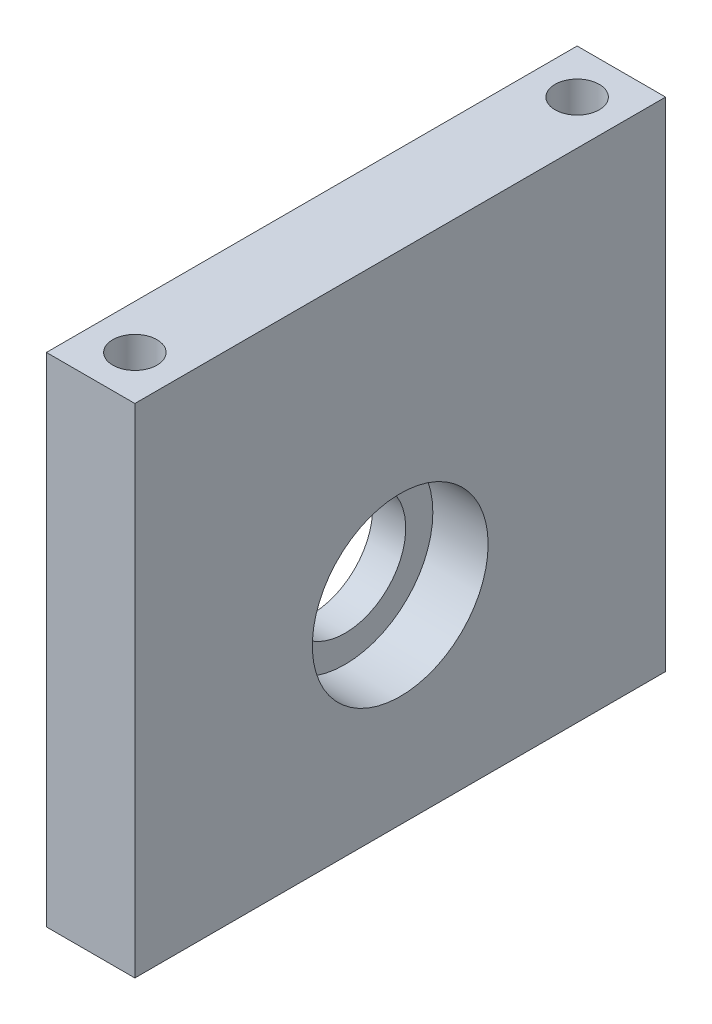
ISO-10303-21;
HEADER;
FILE_DESCRIPTION(('STEP AP214'),'2;1');
FILE_NAME('part.step','',(''),(''),'','','');
FILE_SCHEMA(('AUTOMOTIVE_DESIGN { 1 0 10303 214 1 1 1 1 }'));
ENDSEC;
DATA;
#1=APPLICATION_CONTEXT('core data for automotive mechanical design processes');
#2=APPLICATION_PROTOCOL_DEFINITION('international standard','automotive_design',2000,#1);
#3=PRODUCT_CONTEXT('',#1,'mechanical');
#4=PRODUCT('Part','Part','',(#3));
#5=PRODUCT_RELATED_PRODUCT_CATEGORY('part','',(#4));
#6=PRODUCT_DEFINITION_FORMATION('','',#4);
#7=PRODUCT_DEFINITION_CONTEXT('part definition',#1,'design');
#8=PRODUCT_DEFINITION('design','',#6,#7);
#9=PRODUCT_DEFINITION_SHAPE('','',#8);
#10=(LENGTH_UNIT() NAMED_UNIT(*) SI_UNIT(.MILLI.,.METRE.));
#11=(NAMED_UNIT(*) PLANE_ANGLE_UNIT() SI_UNIT($,.RADIAN.));
#12=(NAMED_UNIT(*) SI_UNIT($,.STERADIAN.) SOLID_ANGLE_UNIT());
#13=UNCERTAINTY_MEASURE_WITH_UNIT(LENGTH_MEASURE(1.E-05),#10,'distance_accuracy_value','');
#14=(GEOMETRIC_REPRESENTATION_CONTEXT(3) GLOBAL_UNCERTAINTY_ASSIGNED_CONTEXT((#13)) GLOBAL_UNIT_ASSIGNED_CONTEXT((#10,
#11,#12)) REPRESENTATION_CONTEXT('',''));
#15=CARTESIAN_POINT('',(0.,0.,0.));
#16=DIRECTION('',(0.,0.,1.));
#17=DIRECTION('',(1.,0.,0.));
#18=AXIS2_PLACEMENT_3D('',#15,#16,#17);
#19=CARTESIAN_POINT('',(-2.,18.,-24.));
#20=DIRECTION('',(1.,0.,0.));
#21=DIRECTION('',(0.,0.,-1.));
#22=AXIS2_PLACEMENT_3D('',#19,#20,#21);
#23=CYLINDRICAL_SURFACE('',#22,7.95);
#24=CARTESIAN_POINT('',(8.,18.,-24.));
#25=DIRECTION('',(1.,0.,0.));
#26=DIRECTION('',(0.,0.,-1.));
#27=AXIS2_PLACEMENT_3D('',#24,#25,#26);
#28=CIRCLE('',#27,7.95);
#29=CARTESIAN_POINT('',(8.,18.,-31.95));
#30=VERTEX_POINT('',#29);
#31=EDGE_CURVE('E111',#30,#30,#28,.T.);
#32=ORIENTED_EDGE('',*,*,#31,.T.);
#33=EDGE_LOOP('',(#32));
#34=FACE_BOUND('',#33,.T.);
#35=CARTESIAN_POINT('',(3.,18.,-24.));
#36=DIRECTION('',(-1.,0.,0.));
#37=DIRECTION('',(0.,0.,1.));
#38=AXIS2_PLACEMENT_3D('',#35,#36,#37);
#39=CIRCLE('',#38,7.95);
#40=CARTESIAN_POINT('',(3.,18.,-16.05));
#41=VERTEX_POINT('',#40);
#42=EDGE_CURVE('E11',#41,#41,#39,.F.);
#43=ORIENTED_EDGE('',*,*,#42,.F.);
#44=EDGE_LOOP('',(#43));
#45=FACE_BOUND('',#44,.T.);
#46=ADVANCED_FACE('F40',(#34,#45),#23,.F.);
#47=CARTESIAN_POINT('',(0.,45.,-48.));
#48=DIRECTION('',(0.,0.,1.));
#49=DIRECTION('',(1.,0.,0.));
#50=AXIS2_PLACEMENT_3D('',#47,#48,#49);
#51=PLANE('',#50);
#52=DIRECTION('',(-1.,0.,0.));
#53=VECTOR('',#52,1.);
#54=CARTESIAN_POINT('',(0.,0.,-48.));
#55=LINE('',#54,#53);
#56=CARTESIAN_POINT('',(8.,0.,-48.));
#57=VERTEX_POINT('',#56);
#58=CARTESIAN_POINT('',(0.,0.,-48.));
#59=VERTEX_POINT('',#58);
#60=EDGE_CURVE('E108',#57,#59,#55,.T.);
#61=ORIENTED_EDGE('',*,*,#60,.T.);
#62=DIRECTION('',(0.,-1.,0.));
#63=VECTOR('',#62,1.);
#64=CARTESIAN_POINT('',(0.,45.,-48.));
#65=LINE('',#64,#63);
#66=CARTESIAN_POINT('',(0.,45.,-48.));
#67=VERTEX_POINT('',#66);
#68=EDGE_CURVE('E49',#67,#59,#65,.T.);
#69=ORIENTED_EDGE('',*,*,#68,.F.);
#70=DIRECTION('',(-1.,0.,0.));
#71=VECTOR('',#70,1.);
#72=CARTESIAN_POINT('',(0.,45.,-48.));
#73=LINE('',#72,#71);
#74=CARTESIAN_POINT('',(8.,45.,-48.));
#75=VERTEX_POINT('',#74);
#76=EDGE_CURVE('E93',#75,#67,#73,.T.);
#77=ORIENTED_EDGE('',*,*,#76,.F.);
#78=DIRECTION('',(0.,-1.,0.));
#79=VECTOR('',#78,1.);
#80=CARTESIAN_POINT('',(8.,45.,-48.));
#81=LINE('',#80,#79);
#82=EDGE_CURVE('E104',#75,#57,#81,.T.);
#83=ORIENTED_EDGE('',*,*,#82,.T.);
#84=EDGE_LOOP('',(#61,#69,#77,#83));
#85=FACE_BOUND('',#84,.T.);
#86=ADVANCED_FACE('F42',(#85),#51,.F.);
#87=CARTESIAN_POINT('',(0.,45.,0.));
#88=DIRECTION('',(1.,0.,0.));
#89=DIRECTION('',(0.,0.,-1.));
#90=AXIS2_PLACEMENT_3D('',#87,#88,#89);
#91=PLANE('',#90);
#92=DIRECTION('',(0.,0.,1.));
#93=VECTOR('',#92,1.);
#94=CARTESIAN_POINT('',(0.,0.,0.));
#95=LINE('',#94,#93);
#96=CARTESIAN_POINT('',(0.,0.,0.));
#97=VERTEX_POINT('',#96);
#98=EDGE_CURVE('E99',#59,#97,#95,.T.);
#99=ORIENTED_EDGE('',*,*,#98,.T.);
#100=DIRECTION('',(0.,-1.,0.));
#101=VECTOR('',#100,1.);
#102=CARTESIAN_POINT('',(0.,45.,0.));
#103=LINE('',#102,#101);
#104=CARTESIAN_POINT('',(0.,45.,0.));
#105=VERTEX_POINT('',#104);
#106=EDGE_CURVE('E96',#105,#97,#103,.T.);
#107=ORIENTED_EDGE('',*,*,#106,.F.);
#108=DIRECTION('',(0.,0.,1.));
#109=VECTOR('',#108,1.);
#110=CARTESIAN_POINT('',(0.,45.,0.));
#111=LINE('',#110,#109);
#112=EDGE_CURVE('E88',#67,#105,#111,.T.);
#113=ORIENTED_EDGE('',*,*,#112,.F.);
#114=ORIENTED_EDGE('',*,*,#68,.T.);
#115=EDGE_LOOP('',(#99,#107,#113,#114));
#116=FACE_BOUND('',#115,.T.);
#117=CARTESIAN_POINT('',(0.,18.,-24.));
#118=DIRECTION('',(-1.,0.,0.));
#119=DIRECTION('',(0.,0.,1.));
#120=AXIS2_PLACEMENT_3D('',#117,#118,#119);
#121=CIRCLE('',#120,5.5);
#122=CARTESIAN_POINT('',(0.,18.,-18.5));
#123=VERTEX_POINT('',#122);
#124=EDGE_CURVE('E203',#123,#123,#121,.T.);
#125=ORIENTED_EDGE('',*,*,#124,.F.);
#126=EDGE_LOOP('',(#125));
#127=FACE_BOUND('',#126,.T.);
#128=ADVANCED_FACE('F97',(#116,#127),#91,.F.);
#129=CARTESIAN_POINT('',(0.,45.,0.));
#130=DIRECTION('',(0.,0.,-1.));
#131=DIRECTION('',(-1.,0.,0.));
#132=AXIS2_PLACEMENT_3D('',#129,#130,#131);
#133=PLANE('',#132);
#134=DIRECTION('',(1.,0.,0.));
#135=VECTOR('',#134,1.);
#136=CARTESIAN_POINT('',(0.,0.,0.));
#137=LINE('',#136,#135);
#138=CARTESIAN_POINT('',(8.,0.,0.));
#139=VERTEX_POINT('',#138);
#140=EDGE_CURVE('E74',#97,#139,#137,.T.);
#141=ORIENTED_EDGE('',*,*,#140,.T.);
#142=DIRECTION('',(0.,-1.,0.));
#143=VECTOR('',#142,1.);
#144=CARTESIAN_POINT('',(8.,45.,0.));
#145=LINE('',#144,#143);
#146=CARTESIAN_POINT('',(8.,45.,0.));
#147=VERTEX_POINT('',#146);
#148=EDGE_CURVE('E100',#147,#139,#145,.T.);
#149=ORIENTED_EDGE('',*,*,#148,.F.);
#150=DIRECTION('',(1.,0.,0.));
#151=VECTOR('',#150,1.);
#152=CARTESIAN_POINT('',(0.,45.,0.));
#153=LINE('',#152,#151);
#154=EDGE_CURVE('E91',#105,#147,#153,.T.);
#155=ORIENTED_EDGE('',*,*,#154,.F.);
#156=ORIENTED_EDGE('',*,*,#106,.T.);
#157=EDGE_LOOP('',(#141,#149,#155,#156));
#158=FACE_BOUND('',#157,.T.);
#159=ADVANCED_FACE('F102',(#158),#133,.F.);
#160=CARTESIAN_POINT('',(8.,45.,0.));
#161=DIRECTION('',(-1.,0.,0.));
#162=DIRECTION('',(0.,0.,1.));
#163=AXIS2_PLACEMENT_3D('',#160,#161,#162);
#164=PLANE('',#163);
#165=ORIENTED_EDGE('',*,*,#31,.F.);
#166=EDGE_LOOP('',(#165));
#167=FACE_BOUND('',#166,.T.);
#168=DIRECTION('',(0.,0.,-1.));
#169=VECTOR('',#168,1.);
#170=CARTESIAN_POINT('',(8.,0.,0.));
#171=LINE('',#170,#169);
#172=EDGE_CURVE('E80',#139,#57,#171,.T.);
#173=ORIENTED_EDGE('',*,*,#172,.T.);
#174=ORIENTED_EDGE('',*,*,#82,.F.);
#175=DIRECTION('',(0.,0.,-1.));
#176=VECTOR('',#175,1.);
#177=CARTESIAN_POINT('',(8.,45.,0.));
#178=LINE('',#177,#176);
#179=EDGE_CURVE('E57',#147,#75,#178,.T.);
#180=ORIENTED_EDGE('',*,*,#179,.F.);
#181=ORIENTED_EDGE('',*,*,#148,.T.);
#182=EDGE_LOOP('',(#173,#174,#180,#181));
#183=FACE_BOUND('',#182,.T.);
#184=ADVANCED_FACE('F131',(#167,#183),#164,.F.);
#185=CARTESIAN_POINT('',(0.,45.,0.));
#186=DIRECTION('',(0.,1.,0.));
#187=DIRECTION('',(0.,0.,1.));
#188=AXIS2_PLACEMENT_3D('',#185,#186,#187);
#189=PLANE('',#188);
#190=CARTESIAN_POINT('',(4.,45.,-44.));
#191=DIRECTION('',(0.,1.,0.));
#192=DIRECTION('',(0.,0.,1.));
#193=AXIS2_PLACEMENT_3D('',#190,#191,#192);
#194=CIRCLE('',#193,2.);
#195=CARTESIAN_POINT('',(4.,45.,-42.));
#196=VERTEX_POINT('',#195);
#197=EDGE_CURVE('E186',#196,#196,#194,.T.);
#198=ORIENTED_EDGE('',*,*,#197,.F.);
#199=EDGE_LOOP('',(#198));
#200=FACE_BOUND('',#199,.T.);
#201=CARTESIAN_POINT('',(4.,45.,-4.));
#202=DIRECTION('',(0.,1.,0.));
#203=DIRECTION('',(0.,0.,1.));
#204=AXIS2_PLACEMENT_3D('',#201,#202,#203);
#205=CIRCLE('',#204,2.);
#206=CARTESIAN_POINT('',(4.,45.,-2.));
#207=VERTEX_POINT('',#206);
#208=EDGE_CURVE('E197',#207,#207,#205,.T.);
#209=ORIENTED_EDGE('',*,*,#208,.F.);
#210=EDGE_LOOP('',(#209));
#211=FACE_BOUND('',#210,.T.);
#212=ORIENTED_EDGE('',*,*,#76,.T.);
#213=ORIENTED_EDGE('',*,*,#112,.T.);
#214=ORIENTED_EDGE('',*,*,#154,.T.);
#215=ORIENTED_EDGE('',*,*,#179,.T.);
#216=EDGE_LOOP('',(#212,#213,#214,#215));
#217=FACE_BOUND('',#216,.T.);
#218=ADVANCED_FACE('F89',(#200,#211,#217),#189,.T.);
#219=CARTESIAN_POINT('',(0.,0.,0.));
#220=DIRECTION('',(0.,1.,0.));
#221=DIRECTION('',(0.,0.,1.));
#222=AXIS2_PLACEMENT_3D('',#219,#220,#221);
#223=PLANE('',#222);
#224=CARTESIAN_POINT('',(4.,0.,-44.));
#225=DIRECTION('',(0.,-1.,0.));
#226=DIRECTION('',(0.,0.,-1.));
#227=AXIS2_PLACEMENT_3D('',#224,#225,#226);
#228=CIRCLE('',#227,2.);
#229=CARTESIAN_POINT('',(4.,0.,-46.));
#230=VERTEX_POINT('',#229);
#231=EDGE_CURVE('E204',#230,#230,#228,.T.);
#232=ORIENTED_EDGE('',*,*,#231,.F.);
#233=EDGE_LOOP('',(#232));
#234=FACE_BOUND('',#233,.T.);
#235=CARTESIAN_POINT('',(4.,0.,-4.));
#236=DIRECTION('',(0.,-1.,0.));
#237=DIRECTION('',(0.,0.,-1.));
#238=AXIS2_PLACEMENT_3D('',#235,#236,#237);
#239=CIRCLE('',#238,2.);
#240=CARTESIAN_POINT('',(4.,0.,-6.));
#241=VERTEX_POINT('',#240);
#242=EDGE_CURVE('E185',#241,#241,#239,.T.);
#243=ORIENTED_EDGE('',*,*,#242,.F.);
#244=EDGE_LOOP('',(#243));
#245=FACE_BOUND('',#244,.T.);
#246=ORIENTED_EDGE('',*,*,#60,.F.);
#247=ORIENTED_EDGE('',*,*,#172,.F.);
#248=ORIENTED_EDGE('',*,*,#140,.F.);
#249=ORIENTED_EDGE('',*,*,#98,.F.);
#250=EDGE_LOOP('',(#246,#247,#248,#249));
#251=FACE_BOUND('',#250,.T.);
#252=ADVANCED_FACE('F119',(#234,#245,#251),#223,.F.);
#253=CARTESIAN_POINT('',(3.,18.,-24.));
#254=DIRECTION('',(-1.,0.,0.));
#255=DIRECTION('',(0.,0.,1.));
#256=AXIS2_PLACEMENT_3D('',#253,#254,#255);
#257=PLANE('',#256);
#258=CARTESIAN_POINT('',(3.,18.,-24.));
#259=DIRECTION('',(-1.,0.,0.));
#260=DIRECTION('',(0.,0.,1.));
#261=AXIS2_PLACEMENT_3D('',#258,#259,#260);
#262=CIRCLE('',#261,5.5);
#263=CARTESIAN_POINT('',(3.,18.,-18.5));
#264=VERTEX_POINT('',#263);
#265=EDGE_CURVE('E209',#264,#264,#262,.T.);
#266=ORIENTED_EDGE('',*,*,#265,.T.);
#267=EDGE_LOOP('',(#266));
#268=FACE_BOUND('',#267,.T.);
#269=ORIENTED_EDGE('',*,*,#42,.T.);
#270=EDGE_LOOP('',(#269));
#271=FACE_BOUND('',#270,.T.);
#272=ADVANCED_FACE('F121',(#268,#271),#257,.F.);
#273=CARTESIAN_POINT('',(3.,18.,-24.));
#274=DIRECTION('',(-1.,0.,0.));
#275=DIRECTION('',(0.,0.,1.));
#276=AXIS2_PLACEMENT_3D('',#273,#274,#275);
#277=CYLINDRICAL_SURFACE('',#276,5.5);
#278=ORIENTED_EDGE('',*,*,#265,.F.);
#279=EDGE_LOOP('',(#278));
#280=FACE_BOUND('',#279,.T.);
#281=ORIENTED_EDGE('',*,*,#124,.T.);
#282=EDGE_LOOP('',(#281));
#283=FACE_BOUND('',#282,.T.);
#284=ADVANCED_FACE('F128',(#280,#283),#277,.F.);
#285=CARTESIAN_POINT('',(4.,15.,-4.));
#286=DIRECTION('',(0.,-1.,0.));
#287=DIRECTION('',(0.,0.,-1.));
#288=AXIS2_PLACEMENT_3D('',#285,#286,#287);
#289=CYLINDRICAL_SURFACE('',#288,2.);
#290=CARTESIAN_POINT('',(4.,15.,-4.));
#291=DIRECTION('',(0.,-1.,0.));
#292=DIRECTION('',(0.,0.,-1.));
#293=AXIS2_PLACEMENT_3D('',#290,#291,#292);
#294=CIRCLE('',#293,2.);
#295=CARTESIAN_POINT('',(4.,15.,-6.));
#296=VERTEX_POINT('',#295);
#297=EDGE_CURVE('E189',#296,#296,#294,.T.);
#298=ORIENTED_EDGE('',*,*,#297,.F.);
#299=EDGE_LOOP('',(#298));
#300=FACE_BOUND('',#299,.T.);
#301=ORIENTED_EDGE('',*,*,#242,.T.);
#302=EDGE_LOOP('',(#301));
#303=FACE_BOUND('',#302,.T.);
#304=ADVANCED_FACE('F148',(#300,#303),#289,.F.);
#305=CARTESIAN_POINT('',(4.,15.,-4.));
#306=DIRECTION('',(0.,-1.,0.));
#307=DIRECTION('',(0.,0.,-1.));
#308=AXIS2_PLACEMENT_3D('',#305,#306,#307);
#309=PLANE('',#308);
#310=ORIENTED_EDGE('',*,*,#297,.T.);
#311=EDGE_LOOP('',(#310));
#312=FACE_BOUND('',#311,.T.);
#313=ADVANCED_FACE('F152',(#312),#309,.T.);
#314=CARTESIAN_POINT('',(4.,15.,-44.));
#315=DIRECTION('',(0.,-1.,0.));
#316=DIRECTION('',(0.,0.,-1.));
#317=AXIS2_PLACEMENT_3D('',#314,#315,#316);
#318=CYLINDRICAL_SURFACE('',#317,2.);
#319=CARTESIAN_POINT('',(4.,15.,-44.));
#320=DIRECTION('',(0.,-1.,0.));
#321=DIRECTION('',(0.,0.,-1.));
#322=AXIS2_PLACEMENT_3D('',#319,#320,#321);
#323=CIRCLE('',#322,2.);
#324=CARTESIAN_POINT('',(4.,15.,-46.));
#325=VERTEX_POINT('',#324);
#326=EDGE_CURVE('E200',#325,#325,#323,.T.);
#327=ORIENTED_EDGE('',*,*,#326,.F.);
#328=EDGE_LOOP('',(#327));
#329=FACE_BOUND('',#328,.T.);
#330=ORIENTED_EDGE('',*,*,#231,.T.);
#331=EDGE_LOOP('',(#330));
#332=FACE_BOUND('',#331,.T.);
#333=ADVANCED_FACE('F156',(#329,#332),#318,.F.);
#334=CARTESIAN_POINT('',(4.,15.,-44.));
#335=DIRECTION('',(0.,-1.,0.));
#336=DIRECTION('',(0.,0.,-1.));
#337=AXIS2_PLACEMENT_3D('',#334,#335,#336);
#338=PLANE('',#337);
#339=ORIENTED_EDGE('',*,*,#326,.T.);
#340=EDGE_LOOP('',(#339));
#341=FACE_BOUND('',#340,.T.);
#342=ADVANCED_FACE('F160',(#341),#338,.T.);
#343=CARTESIAN_POINT('',(4.,30.,-4.));
#344=DIRECTION('',(0.,1.,0.));
#345=DIRECTION('',(0.,0.,1.));
#346=AXIS2_PLACEMENT_3D('',#343,#344,#345);
#347=CYLINDRICAL_SURFACE('',#346,2.);
#348=CARTESIAN_POINT('',(4.,30.,-4.));
#349=DIRECTION('',(0.,1.,0.));
#350=DIRECTION('',(0.,0.,1.));
#351=AXIS2_PLACEMENT_3D('',#348,#349,#350);
#352=CIRCLE('',#351,2.);
#353=CARTESIAN_POINT('',(4.,30.,-2.));
#354=VERTEX_POINT('',#353);
#355=EDGE_CURVE('E192',#354,#354,#352,.T.);
#356=ORIENTED_EDGE('',*,*,#355,.F.);
#357=EDGE_LOOP('',(#356));
#358=FACE_BOUND('',#357,.T.);
#359=ORIENTED_EDGE('',*,*,#208,.T.);
#360=EDGE_LOOP('',(#359));
#361=FACE_BOUND('',#360,.T.);
#362=ADVANCED_FACE('F164',(#358,#361),#347,.F.);
#363=CARTESIAN_POINT('',(4.,30.,-4.));
#364=DIRECTION('',(0.,1.,0.));
#365=DIRECTION('',(0.,0.,1.));
#366=AXIS2_PLACEMENT_3D('',#363,#364,#365);
#367=PLANE('',#366);
#368=ORIENTED_EDGE('',*,*,#355,.T.);
#369=EDGE_LOOP('',(#368));
#370=FACE_BOUND('',#369,.T.);
#371=ADVANCED_FACE('F168',(#370),#367,.T.);
#372=CARTESIAN_POINT('',(4.,30.,-44.));
#373=DIRECTION('',(0.,1.,0.));
#374=DIRECTION('',(0.,0.,1.));
#375=AXIS2_PLACEMENT_3D('',#372,#373,#374);
#376=CYLINDRICAL_SURFACE('',#375,2.);
#377=CARTESIAN_POINT('',(4.,30.,-44.));
#378=DIRECTION('',(0.,1.,0.));
#379=DIRECTION('',(0.,0.,1.));
#380=AXIS2_PLACEMENT_3D('',#377,#378,#379);
#381=CIRCLE('',#380,2.);
#382=CARTESIAN_POINT('',(4.,30.,-42.));
#383=VERTEX_POINT('',#382);
#384=EDGE_CURVE('E184',#383,#383,#381,.T.);
#385=ORIENTED_EDGE('',*,*,#384,.F.);
#386=EDGE_LOOP('',(#385));
#387=FACE_BOUND('',#386,.T.);
#388=ORIENTED_EDGE('',*,*,#197,.T.);
#389=EDGE_LOOP('',(#388));
#390=FACE_BOUND('',#389,.T.);
#391=ADVANCED_FACE('F172',(#387,#390),#376,.F.);
#392=CARTESIAN_POINT('',(4.,30.,-44.));
#393=DIRECTION('',(0.,1.,0.));
#394=DIRECTION('',(0.,0.,1.));
#395=AXIS2_PLACEMENT_3D('',#392,#393,#394);
#396=PLANE('',#395);
#397=ORIENTED_EDGE('',*,*,#384,.T.);
#398=EDGE_LOOP('',(#397));
#399=FACE_BOUND('',#398,.T.);
#400=ADVANCED_FACE('F176',(#399),#396,.T.);
#401=CLOSED_SHELL('',(#46,#86,#128,#159,#184,#218,#252,#272,#284,#304,#313,#333,#342,#362,#371,
#391,#400));
#402=MANIFOLD_SOLID_BREP('B2',#401);
#403=ADVANCED_BREP_SHAPE_REPRESENTATION('',(#18,#402),#14);
#404=SHAPE_DEFINITION_REPRESENTATION(#9,#403);
ENDSEC;
END-ISO-10303-21;
